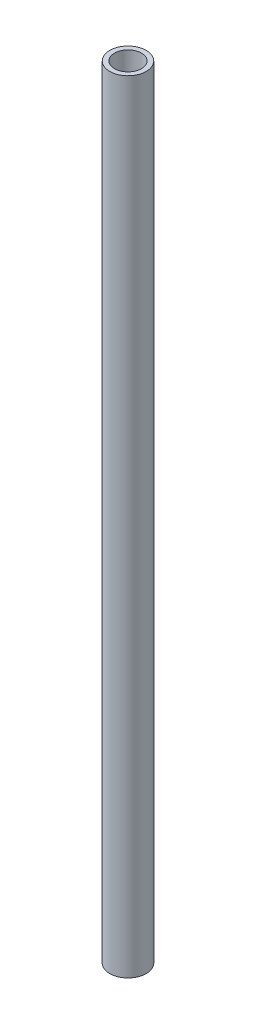
ISO-10303-21;
HEADER;
FILE_DESCRIPTION(('STEP AP214'),'2;1');
FILE_NAME('part.step','',(''),(''),'','','');
FILE_SCHEMA(('AUTOMOTIVE_DESIGN { 1 0 10303 214 1 1 1 1 }'));
ENDSEC;
DATA;
#1=APPLICATION_CONTEXT('core data for automotive mechanical design processes');
#2=APPLICATION_PROTOCOL_DEFINITION('international standard','automotive_design',2000,#1);
#3=PRODUCT_CONTEXT('',#1,'mechanical');
#4=PRODUCT('Part','Part','',(#3));
#5=PRODUCT_RELATED_PRODUCT_CATEGORY('part','',(#4));
#6=PRODUCT_DEFINITION_FORMATION('','',#4);
#7=PRODUCT_DEFINITION_CONTEXT('part definition',#1,'design');
#8=PRODUCT_DEFINITION('design','',#6,#7);
#9=PRODUCT_DEFINITION_SHAPE('','',#8);
#10=(LENGTH_UNIT() NAMED_UNIT(*) SI_UNIT(.MILLI.,.METRE.));
#11=(NAMED_UNIT(*) PLANE_ANGLE_UNIT() SI_UNIT($,.RADIAN.));
#12=(NAMED_UNIT(*) SI_UNIT($,.STERADIAN.) SOLID_ANGLE_UNIT());
#13=UNCERTAINTY_MEASURE_WITH_UNIT(LENGTH_MEASURE(1.E-05),#10,'distance_accuracy_value','');
#14=(GEOMETRIC_REPRESENTATION_CONTEXT(3) GLOBAL_UNCERTAINTY_ASSIGNED_CONTEXT((#13)) GLOBAL_UNIT_ASSIGNED_CONTEXT((#10,
#11,#12)) REPRESENTATION_CONTEXT('',''));
#15=CARTESIAN_POINT('',(0.,0.,0.));
#16=DIRECTION('',(0.,0.,1.));
#17=DIRECTION('',(1.,0.,0.));
#18=AXIS2_PLACEMENT_3D('',#15,#16,#17);
#19=CARTESIAN_POINT('',(0.,457.2,0.));
#20=DIRECTION('',(0.,1.,0.));
#21=DIRECTION('',(0.,0.,1.));
#22=AXIS2_PLACEMENT_3D('',#19,#20,#21);
#23=PLANE('',#22);
#24=CARTESIAN_POINT('',(0.,457.2,0.));
#25=DIRECTION('',(0.,1.,0.));
#26=DIRECTION('',(0.,0.,1.));
#27=AXIS2_PLACEMENT_3D('',#24,#25,#26);
#28=CIRCLE('',#27,10.668);
#29=CARTESIAN_POINT('',(0.,457.2,10.668));
#30=VERTEX_POINT('',#29);
#31=EDGE_CURVE('E10',#30,#30,#28,.T.);
#32=ORIENTED_EDGE('',*,*,#31,.T.);
#33=EDGE_LOOP('',(#32));
#34=FACE_BOUND('',#33,.T.);
#35=CARTESIAN_POINT('',(0.,457.2,0.));
#36=DIRECTION('',(0.,1.,0.));
#37=DIRECTION('',(0.,0.,1.));
#38=AXIS2_PLACEMENT_3D('',#35,#36,#37);
#39=CIRCLE('',#38,7.8994);
#40=CARTESIAN_POINT('',(0.,457.2,7.8994));
#41=VERTEX_POINT('',#40);
#42=EDGE_CURVE('E44',#41,#41,#39,.T.);
#43=ORIENTED_EDGE('',*,*,#42,.F.);
#44=EDGE_LOOP('',(#43));
#45=FACE_BOUND('',#44,.T.);
#46=ADVANCED_FACE('F33',(#34,#45),#23,.T.);
#47=CARTESIAN_POINT('',(0.,0.,0.));
#48=DIRECTION('',(0.,1.,0.));
#49=DIRECTION('',(0.,0.,1.));
#50=AXIS2_PLACEMENT_3D('',#47,#48,#49);
#51=PLANE('',#50);
#52=CARTESIAN_POINT('',(0.,0.,0.));
#53=DIRECTION('',(0.,1.,0.));
#54=DIRECTION('',(0.,0.,1.));
#55=AXIS2_PLACEMENT_3D('',#52,#53,#54);
#56=CIRCLE('',#55,10.668);
#57=CARTESIAN_POINT('',(0.,0.,10.668));
#58=VERTEX_POINT('',#57);
#59=EDGE_CURVE('E37',#58,#58,#56,.T.);
#60=ORIENTED_EDGE('',*,*,#59,.F.);
#61=EDGE_LOOP('',(#60));
#62=FACE_BOUND('',#61,.T.);
#63=CARTESIAN_POINT('',(0.,0.,0.));
#64=DIRECTION('',(0.,1.,0.));
#65=DIRECTION('',(0.,0.,1.));
#66=AXIS2_PLACEMENT_3D('',#63,#64,#65);
#67=CIRCLE('',#66,7.8994);
#68=CARTESIAN_POINT('',(0.,0.,7.8994));
#69=VERTEX_POINT('',#68);
#70=EDGE_CURVE('E46',#69,#69,#67,.T.);
#71=ORIENTED_EDGE('',*,*,#70,.T.);
#72=EDGE_LOOP('',(#71));
#73=FACE_BOUND('',#72,.T.);
#74=ADVANCED_FACE('F56',(#62,#73),#51,.F.);
#75=CARTESIAN_POINT('',(0.,457.2,0.));
#76=DIRECTION('',(0.,-1.,0.));
#77=DIRECTION('',(0.,0.,-1.));
#78=AXIS2_PLACEMENT_3D('',#75,#76,#77);
#79=CYLINDRICAL_SURFACE('',#78,10.668);
#80=ORIENTED_EDGE('',*,*,#31,.F.);
#81=EDGE_LOOP('',(#80));
#82=FACE_BOUND('',#81,.T.);
#83=ORIENTED_EDGE('',*,*,#59,.T.);
#84=EDGE_LOOP('',(#83));
#85=FACE_BOUND('',#84,.T.);
#86=ADVANCED_FACE('F35',(#82,#85),#79,.T.);
#87=CARTESIAN_POINT('',(0.,457.2,0.));
#88=DIRECTION('',(0.,-1.,0.));
#89=DIRECTION('',(0.,0.,-1.));
#90=AXIS2_PLACEMENT_3D('',#87,#88,#89);
#91=CYLINDRICAL_SURFACE('',#90,7.8994);
#92=ORIENTED_EDGE('',*,*,#42,.T.);
#93=EDGE_LOOP('',(#92));
#94=FACE_BOUND('',#93,.T.);
#95=ORIENTED_EDGE('',*,*,#70,.F.);
#96=EDGE_LOOP('',(#95));
#97=FACE_BOUND('',#96,.T.);
#98=ADVANCED_FACE('F52',(#94,#97),#91,.F.);
#99=CLOSED_SHELL('',(#46,#74,#86,#98));
#100=MANIFOLD_SOLID_BREP('B2',#99);
#101=ADVANCED_BREP_SHAPE_REPRESENTATION('',(#18,#100),#14);
#102=SHAPE_DEFINITION_REPRESENTATION(#9,#101);
ENDSEC;
END-ISO-10303-21;
